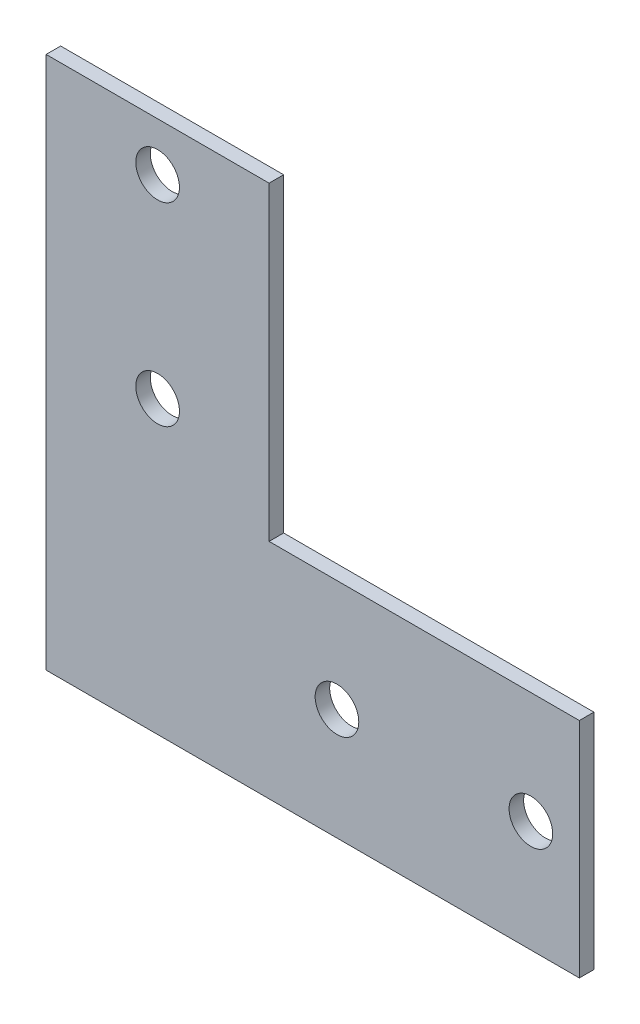
ISO-10303-21;
HEADER;
FILE_DESCRIPTION(('STEP AP214'),'2;1');
FILE_NAME('part.step','',(''),(''),'','','');
FILE_SCHEMA(('AUTOMOTIVE_DESIGN { 1 0 10303 214 1 1 1 1 }'));
ENDSEC;
DATA;
#1=APPLICATION_CONTEXT('core data for automotive mechanical design processes');
#2=APPLICATION_PROTOCOL_DEFINITION('international standard','automotive_design',2000,#1);
#3=PRODUCT_CONTEXT('',#1,'mechanical');
#4=PRODUCT('Part','Part','',(#3));
#5=PRODUCT_RELATED_PRODUCT_CATEGORY('part','',(#4));
#6=PRODUCT_DEFINITION_FORMATION('','',#4);
#7=PRODUCT_DEFINITION_CONTEXT('part definition',#1,'design');
#8=PRODUCT_DEFINITION('design','',#6,#7);
#9=PRODUCT_DEFINITION_SHAPE('','',#8);
#10=(LENGTH_UNIT() NAMED_UNIT(*) SI_UNIT(.MILLI.,.METRE.));
#11=(NAMED_UNIT(*) PLANE_ANGLE_UNIT() SI_UNIT($,.RADIAN.));
#12=(NAMED_UNIT(*) SI_UNIT($,.STERADIAN.) SOLID_ANGLE_UNIT());
#13=UNCERTAINTY_MEASURE_WITH_UNIT(LENGTH_MEASURE(1.E-05),#10,'distance_accuracy_value','');
#14=(GEOMETRIC_REPRESENTATION_CONTEXT(3) GLOBAL_UNCERTAINTY_ASSIGNED_CONTEXT((#13)) GLOBAL_UNIT_ASSIGNED_CONTEXT((#10,
#11,#12)) REPRESENTATION_CONTEXT('',''));
#15=CARTESIAN_POINT('',(0.,0.,0.));
#16=DIRECTION('',(0.,0.,1.));
#17=DIRECTION('',(1.,0.,0.));
#18=AXIS2_PLACEMENT_3D('',#15,#16,#17);
#19=CARTESIAN_POINT('',(0.,0.,3.));
#20=DIRECTION('',(0.,0.,1.));
#21=DIRECTION('',(1.,0.,0.));
#22=AXIS2_PLACEMENT_3D('',#19,#20,#21);
#23=PLANE('',#22);
#24=CARTESIAN_POINT('',(60.,23.,3.));
#25=DIRECTION('',(0.,0.,1.));
#26=DIRECTION('',(1.,0.,0.));
#27=AXIS2_PLACEMENT_3D('',#24,#25,#26);
#28=CIRCLE('',#27,4.5);
#29=CARTESIAN_POINT('',(64.5,23.,3.));
#30=VERTEX_POINT('',#29);
#31=EDGE_CURVE('E190',#30,#30,#28,.T.);
#32=ORIENTED_EDGE('',*,*,#31,.F.);
#33=EDGE_LOOP('',(#32));
#34=FACE_BOUND('',#33,.T.);
#35=CARTESIAN_POINT('',(23.,100.,3.));
#36=DIRECTION('',(0.,0.,1.));
#37=DIRECTION('',(1.,0.,0.));
#38=AXIS2_PLACEMENT_3D('',#35,#36,#37);
#39=CIRCLE('',#38,4.50000000000001);
#40=CARTESIAN_POINT('',(27.5,100.,3.));
#41=VERTEX_POINT('',#40);
#42=EDGE_CURVE('E123',#41,#41,#39,.T.);
#43=ORIENTED_EDGE('',*,*,#42,.F.);
#44=EDGE_LOOP('',(#43));
#45=FACE_BOUND('',#44,.T.);
#46=DIRECTION('',(-1.,0.,0.));
#47=VECTOR('',#46,1.);
#48=CARTESIAN_POINT('',(46.,110.,3.));
#49=LINE('',#48,#47);
#50=CARTESIAN_POINT('',(46.,110.,3.));
#51=VERTEX_POINT('',#50);
#52=CARTESIAN_POINT('',(0.,110.,3.));
#53=VERTEX_POINT('',#52);
#54=EDGE_CURVE('E130',#51,#53,#49,.T.);
#55=ORIENTED_EDGE('',*,*,#54,.T.);
#56=DIRECTION('',(0.,-1.,0.));
#57=VECTOR('',#56,1.);
#58=CARTESIAN_POINT('',(0.,110.,3.));
#59=LINE('',#58,#57);
#60=CARTESIAN_POINT('',(0.,0.,3.));
#61=VERTEX_POINT('',#60);
#62=EDGE_CURVE('E88',#53,#61,#59,.T.);
#63=ORIENTED_EDGE('',*,*,#62,.T.);
#64=DIRECTION('',(1.,0.,0.));
#65=VECTOR('',#64,1.);
#66=CARTESIAN_POINT('',(0.,0.,3.));
#67=LINE('',#66,#65);
#68=CARTESIAN_POINT('',(110.,0.,3.));
#69=VERTEX_POINT('',#68);
#70=EDGE_CURVE('E101',#61,#69,#67,.T.);
#71=ORIENTED_EDGE('',*,*,#70,.T.);
#72=DIRECTION('',(0.,1.,0.));
#73=VECTOR('',#72,1.);
#74=CARTESIAN_POINT('',(110.,0.,3.));
#75=LINE('',#74,#73);
#76=CARTESIAN_POINT('',(110.,46.,3.));
#77=VERTEX_POINT('',#76);
#78=EDGE_CURVE('E95',#69,#77,#75,.T.);
#79=ORIENTED_EDGE('',*,*,#78,.T.);
#80=DIRECTION('',(-1.,0.,0.));
#81=VECTOR('',#80,1.);
#82=CARTESIAN_POINT('',(110.,46.,3.));
#83=LINE('',#82,#81);
#84=CARTESIAN_POINT('',(46.,46.,3.));
#85=VERTEX_POINT('',#84);
#86=EDGE_CURVE('E99',#77,#85,#83,.T.);
#87=ORIENTED_EDGE('',*,*,#86,.T.);
#88=DIRECTION('',(0.,1.,0.));
#89=VECTOR('',#88,1.);
#90=CARTESIAN_POINT('',(46.,46.,3.));
#91=LINE('',#90,#89);
#92=EDGE_CURVE('E51',#85,#51,#91,.T.);
#93=ORIENTED_EDGE('',*,*,#92,.T.);
#94=EDGE_LOOP('',(#55,#63,#71,#79,#87,#93));
#95=FACE_BOUND('',#94,.T.);
#96=CARTESIAN_POINT('',(23.,60.,3.));
#97=DIRECTION('',(0.,0.,1.));
#98=DIRECTION('',(1.,0.,0.));
#99=AXIS2_PLACEMENT_3D('',#96,#97,#98);
#100=CIRCLE('',#99,4.50000000000001);
#101=CARTESIAN_POINT('',(27.5,60.,3.));
#102=VERTEX_POINT('',#101);
#103=EDGE_CURVE('E196',#102,#102,#100,.T.);
#104=ORIENTED_EDGE('',*,*,#103,.F.);
#105=EDGE_LOOP('',(#104));
#106=FACE_BOUND('',#105,.T.);
#107=CARTESIAN_POINT('',(100.,23.,3.));
#108=DIRECTION('',(0.,0.,1.));
#109=DIRECTION('',(1.,0.,0.));
#110=AXIS2_PLACEMENT_3D('',#107,#108,#109);
#111=CIRCLE('',#110,4.5);
#112=CARTESIAN_POINT('',(104.5,23.,3.));
#113=VERTEX_POINT('',#112);
#114=EDGE_CURVE('E181',#113,#113,#111,.T.);
#115=ORIENTED_EDGE('',*,*,#114,.F.);
#116=EDGE_LOOP('',(#115));
#117=FACE_BOUND('',#116,.T.);
#118=ADVANCED_FACE('F34',(#34,#45,#95,#106,#117),#23,.T.);
#119=CARTESIAN_POINT('',(0.,0.,0.));
#120=DIRECTION('',(0.,0.,1.));
#121=DIRECTION('',(1.,0.,0.));
#122=AXIS2_PLACEMENT_3D('',#119,#120,#121);
#123=PLANE('',#122);
#124=DIRECTION('',(-1.,0.,0.));
#125=VECTOR('',#124,1.);
#126=CARTESIAN_POINT('',(46.,110.,0.));
#127=LINE('',#126,#125);
#128=CARTESIAN_POINT('',(46.,110.,0.));
#129=VERTEX_POINT('',#128);
#130=CARTESIAN_POINT('',(0.,110.,0.));
#131=VERTEX_POINT('',#130);
#132=EDGE_CURVE('E119',#129,#131,#127,.T.);
#133=ORIENTED_EDGE('',*,*,#132,.F.);
#134=DIRECTION('',(0.,1.,0.));
#135=VECTOR('',#134,1.);
#136=CARTESIAN_POINT('',(46.,46.,0.));
#137=LINE('',#136,#135);
#138=CARTESIAN_POINT('',(46.,46.,0.));
#139=VERTEX_POINT('',#138);
#140=EDGE_CURVE('E80',#139,#129,#137,.T.);
#141=ORIENTED_EDGE('',*,*,#140,.F.);
#142=DIRECTION('',(-1.,0.,0.));
#143=VECTOR('',#142,1.);
#144=CARTESIAN_POINT('',(110.,46.,0.));
#145=LINE('',#144,#143);
#146=CARTESIAN_POINT('',(110.,46.,0.));
#147=VERTEX_POINT('',#146);
#148=EDGE_CURVE('E74',#147,#139,#145,.T.);
#149=ORIENTED_EDGE('',*,*,#148,.F.);
#150=DIRECTION('',(0.,1.,0.));
#151=VECTOR('',#150,1.);
#152=CARTESIAN_POINT('',(110.,0.,0.));
#153=LINE('',#152,#151);
#154=CARTESIAN_POINT('',(110.,0.,0.));
#155=VERTEX_POINT('',#154);
#156=EDGE_CURVE('E109',#155,#147,#153,.T.);
#157=ORIENTED_EDGE('',*,*,#156,.F.);
#158=DIRECTION('',(1.,0.,0.));
#159=VECTOR('',#158,1.);
#160=CARTESIAN_POINT('',(0.,0.,0.));
#161=LINE('',#160,#159);
#162=CARTESIAN_POINT('',(0.,0.,0.));
#163=VERTEX_POINT('',#162);
#164=EDGE_CURVE('E125',#163,#155,#161,.T.);
#165=ORIENTED_EDGE('',*,*,#164,.F.);
#166=DIRECTION('',(0.,-1.,0.));
#167=VECTOR('',#166,1.);
#168=CARTESIAN_POINT('',(0.,110.,0.));
#169=LINE('',#168,#167);
#170=EDGE_CURVE('E122',#131,#163,#169,.T.);
#171=ORIENTED_EDGE('',*,*,#170,.F.);
#172=EDGE_LOOP('',(#133,#141,#149,#157,#165,#171));
#173=FACE_BOUND('',#172,.T.);
#174=CARTESIAN_POINT('',(23.,100.,0.));
#175=DIRECTION('',(0.,0.,1.));
#176=DIRECTION('',(1.,0.,0.));
#177=AXIS2_PLACEMENT_3D('',#174,#175,#176);
#178=CIRCLE('',#177,4.50000000000001);
#179=CARTESIAN_POINT('',(27.5,100.,0.));
#180=VERTEX_POINT('',#179);
#181=EDGE_CURVE('E199',#180,#180,#178,.T.);
#182=ORIENTED_EDGE('',*,*,#181,.T.);
#183=EDGE_LOOP('',(#182));
#184=FACE_BOUND('',#183,.T.);
#185=CARTESIAN_POINT('',(23.,60.,0.));
#186=DIRECTION('',(0.,0.,1.));
#187=DIRECTION('',(1.,0.,0.));
#188=AXIS2_PLACEMENT_3D('',#185,#186,#187);
#189=CIRCLE('',#188,4.50000000000001);
#190=CARTESIAN_POINT('',(27.5,60.,0.));
#191=VERTEX_POINT('',#190);
#192=EDGE_CURVE('E193',#191,#191,#189,.T.);
#193=ORIENTED_EDGE('',*,*,#192,.T.);
#194=EDGE_LOOP('',(#193));
#195=FACE_BOUND('',#194,.T.);
#196=CARTESIAN_POINT('',(60.,23.,0.));
#197=DIRECTION('',(0.,0.,1.));
#198=DIRECTION('',(1.,0.,0.));
#199=AXIS2_PLACEMENT_3D('',#196,#197,#198);
#200=CIRCLE('',#199,4.5);
#201=CARTESIAN_POINT('',(64.5,23.,0.));
#202=VERTEX_POINT('',#201);
#203=EDGE_CURVE('E187',#202,#202,#200,.T.);
#204=ORIENTED_EDGE('',*,*,#203,.T.);
#205=EDGE_LOOP('',(#204));
#206=FACE_BOUND('',#205,.T.);
#207=CARTESIAN_POINT('',(100.,23.,0.));
#208=DIRECTION('',(0.,0.,1.));
#209=DIRECTION('',(1.,0.,0.));
#210=AXIS2_PLACEMENT_3D('',#207,#208,#209);
#211=CIRCLE('',#210,4.5);
#212=CARTESIAN_POINT('',(104.5,23.,0.));
#213=VERTEX_POINT('',#212);
#214=EDGE_CURVE('E184',#213,#213,#211,.T.);
#215=ORIENTED_EDGE('',*,*,#214,.T.);
#216=EDGE_LOOP('',(#215));
#217=FACE_BOUND('',#216,.T.);
#218=ADVANCED_FACE('F139',(#173,#184,#195,#206,#217),#123,.F.);
#219=CARTESIAN_POINT('',(46.,110.,3.));
#220=DIRECTION('',(0.,-1.,0.));
#221=DIRECTION('',(1.,0.,0.));
#222=AXIS2_PLACEMENT_3D('',#219,#220,#221);
#223=PLANE('',#222);
#224=ORIENTED_EDGE('',*,*,#132,.T.);
#225=DIRECTION('',(0.,0.,-1.));
#226=VECTOR('',#225,1.);
#227=CARTESIAN_POINT('',(0.,110.,3.));
#228=LINE('',#227,#226);
#229=EDGE_CURVE('E11',#53,#131,#228,.T.);
#230=ORIENTED_EDGE('',*,*,#229,.F.);
#231=ORIENTED_EDGE('',*,*,#54,.F.);
#232=DIRECTION('',(0.,0.,-1.));
#233=VECTOR('',#232,1.);
#234=CARTESIAN_POINT('',(46.,110.,3.));
#235=LINE('',#234,#233);
#236=EDGE_CURVE('E115',#51,#129,#235,.T.);
#237=ORIENTED_EDGE('',*,*,#236,.T.);
#238=EDGE_LOOP('',(#224,#230,#231,#237));
#239=FACE_BOUND('',#238,.T.);
#240=ADVANCED_FACE('F36',(#239),#223,.F.);
#241=CARTESIAN_POINT('',(0.,110.,3.));
#242=DIRECTION('',(1.,0.,0.));
#243=DIRECTION('',(0.,1.,0.));
#244=AXIS2_PLACEMENT_3D('',#241,#242,#243);
#245=PLANE('',#244);
#246=ORIENTED_EDGE('',*,*,#170,.T.);
#247=DIRECTION('',(0.,0.,-1.));
#248=VECTOR('',#247,1.);
#249=CARTESIAN_POINT('',(0.,0.,3.));
#250=LINE('',#249,#248);
#251=EDGE_CURVE('E43',#61,#163,#250,.T.);
#252=ORIENTED_EDGE('',*,*,#251,.F.);
#253=ORIENTED_EDGE('',*,*,#62,.F.);
#254=ORIENTED_EDGE('',*,*,#229,.T.);
#255=EDGE_LOOP('',(#246,#252,#253,#254));
#256=FACE_BOUND('',#255,.T.);
#257=ADVANCED_FACE('F257',(#256),#245,.F.);
#258=CARTESIAN_POINT('',(0.,0.,3.));
#259=DIRECTION('',(0.,1.,0.));
#260=DIRECTION('',(0.,0.,1.));
#261=AXIS2_PLACEMENT_3D('',#258,#259,#260);
#262=PLANE('',#261);
#263=ORIENTED_EDGE('',*,*,#164,.T.);
#264=DIRECTION('',(0.,0.,-1.));
#265=VECTOR('',#264,1.);
#266=CARTESIAN_POINT('',(110.,0.,3.));
#267=LINE('',#266,#265);
#268=EDGE_CURVE('E110',#69,#155,#267,.T.);
#269=ORIENTED_EDGE('',*,*,#268,.F.);
#270=ORIENTED_EDGE('',*,*,#70,.F.);
#271=ORIENTED_EDGE('',*,*,#251,.T.);
#272=EDGE_LOOP('',(#263,#269,#270,#271));
#273=FACE_BOUND('',#272,.T.);
#274=ADVANCED_FACE('F136',(#273),#262,.F.);
#275=CARTESIAN_POINT('',(110.,0.,3.));
#276=DIRECTION('',(-1.,0.,0.));
#277=DIRECTION('',(0.,-1.,0.));
#278=AXIS2_PLACEMENT_3D('',#275,#276,#277);
#279=PLANE('',#278);
#280=ORIENTED_EDGE('',*,*,#156,.T.);
#281=DIRECTION('',(0.,0.,-1.));
#282=VECTOR('',#281,1.);
#283=CARTESIAN_POINT('',(110.,46.,3.));
#284=LINE('',#283,#282);
#285=EDGE_CURVE('E106',#77,#147,#284,.T.);
#286=ORIENTED_EDGE('',*,*,#285,.F.);
#287=ORIENTED_EDGE('',*,*,#78,.F.);
#288=ORIENTED_EDGE('',*,*,#268,.T.);
#289=EDGE_LOOP('',(#280,#286,#287,#288));
#290=FACE_BOUND('',#289,.T.);
#291=ADVANCED_FACE('F107',(#290),#279,.F.);
#292=CARTESIAN_POINT('',(110.,46.,3.));
#293=DIRECTION('',(0.,-1.,0.));
#294=DIRECTION('',(1.,0.,0.));
#295=AXIS2_PLACEMENT_3D('',#292,#293,#294);
#296=PLANE('',#295);
#297=ORIENTED_EDGE('',*,*,#148,.T.);
#298=DIRECTION('',(0.,0.,-1.));
#299=VECTOR('',#298,1.);
#300=CARTESIAN_POINT('',(46.,46.,3.));
#301=LINE('',#300,#299);
#302=EDGE_CURVE('E111',#85,#139,#301,.T.);
#303=ORIENTED_EDGE('',*,*,#302,.F.);
#304=ORIENTED_EDGE('',*,*,#86,.F.);
#305=ORIENTED_EDGE('',*,*,#285,.T.);
#306=EDGE_LOOP('',(#297,#303,#304,#305));
#307=FACE_BOUND('',#306,.T.);
#308=ADVANCED_FACE('F113',(#307),#296,.F.);
#309=CARTESIAN_POINT('',(46.,46.,3.));
#310=DIRECTION('',(-1.,0.,0.));
#311=DIRECTION('',(0.,-1.,0.));
#312=AXIS2_PLACEMENT_3D('',#309,#310,#311);
#313=PLANE('',#312);
#314=ORIENTED_EDGE('',*,*,#140,.T.);
#315=ORIENTED_EDGE('',*,*,#236,.F.);
#316=ORIENTED_EDGE('',*,*,#92,.F.);
#317=ORIENTED_EDGE('',*,*,#302,.T.);
#318=EDGE_LOOP('',(#314,#315,#316,#317));
#319=FACE_BOUND('',#318,.T.);
#320=ADVANCED_FACE('F144',(#319),#313,.F.);
#321=CARTESIAN_POINT('',(23.,100.,3.));
#322=DIRECTION('',(0.,0.,-1.));
#323=DIRECTION('',(-1.,0.,0.));
#324=AXIS2_PLACEMENT_3D('',#321,#322,#323);
#325=CYLINDRICAL_SURFACE('',#324,4.50000000000001);
#326=ORIENTED_EDGE('',*,*,#42,.T.);
#327=EDGE_LOOP('',(#326));
#328=FACE_BOUND('',#327,.T.);
#329=ORIENTED_EDGE('',*,*,#181,.F.);
#330=EDGE_LOOP('',(#329));
#331=FACE_BOUND('',#330,.T.);
#332=ADVANCED_FACE('F146',(#328,#331),#325,.F.);
#333=CARTESIAN_POINT('',(23.,60.,3.));
#334=DIRECTION('',(0.,0.,-1.));
#335=DIRECTION('',(-1.,0.,0.));
#336=AXIS2_PLACEMENT_3D('',#333,#334,#335);
#337=CYLINDRICAL_SURFACE('',#336,4.50000000000001);
#338=ORIENTED_EDGE('',*,*,#103,.T.);
#339=EDGE_LOOP('',(#338));
#340=FACE_BOUND('',#339,.T.);
#341=ORIENTED_EDGE('',*,*,#192,.F.);
#342=EDGE_LOOP('',(#341));
#343=FACE_BOUND('',#342,.T.);
#344=ADVANCED_FACE('F152',(#340,#343),#337,.F.);
#345=CARTESIAN_POINT('',(60.,23.,3.));
#346=DIRECTION('',(0.,0.,-1.));
#347=DIRECTION('',(-1.,0.,0.));
#348=AXIS2_PLACEMENT_3D('',#345,#346,#347);
#349=CYLINDRICAL_SURFACE('',#348,4.5);
#350=ORIENTED_EDGE('',*,*,#31,.T.);
#351=EDGE_LOOP('',(#350));
#352=FACE_BOUND('',#351,.T.);
#353=ORIENTED_EDGE('',*,*,#203,.F.);
#354=EDGE_LOOP('',(#353));
#355=FACE_BOUND('',#354,.T.);
#356=ADVANCED_FACE('F168',(#352,#355),#349,.F.);
#357=CARTESIAN_POINT('',(100.,23.,3.));
#358=DIRECTION('',(0.,0.,-1.));
#359=DIRECTION('',(-1.,0.,0.));
#360=AXIS2_PLACEMENT_3D('',#357,#358,#359);
#361=CYLINDRICAL_SURFACE('',#360,4.5);
#362=ORIENTED_EDGE('',*,*,#114,.T.);
#363=EDGE_LOOP('',(#362));
#364=FACE_BOUND('',#363,.T.);
#365=ORIENTED_EDGE('',*,*,#214,.F.);
#366=EDGE_LOOP('',(#365));
#367=FACE_BOUND('',#366,.T.);
#368=ADVANCED_FACE('F172',(#364,#367),#361,.F.);
#369=CLOSED_SHELL('',(#118,#218,#240,#257,#274,#291,#308,#320,#332,#344,#356,#368));
#370=MANIFOLD_SOLID_BREP('B2',#369);
#371=ADVANCED_BREP_SHAPE_REPRESENTATION('',(#18,#370),#14);
#372=SHAPE_DEFINITION_REPRESENTATION(#9,#371);
ENDSEC;
END-ISO-10303-21;
